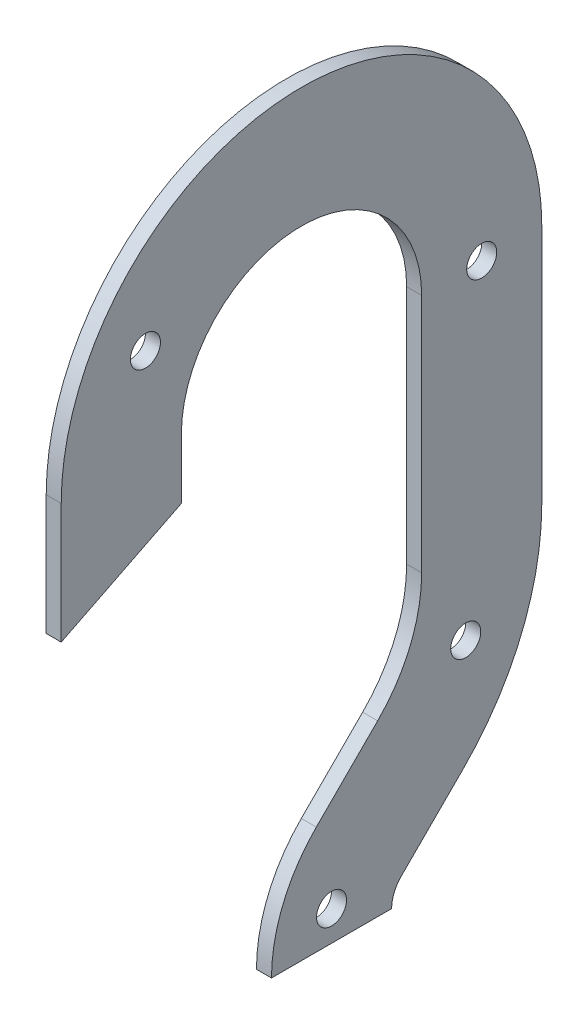
ISO-10303-21;
HEADER;
FILE_DESCRIPTION(('STEP AP214'),'2;1');
FILE_NAME('part.step','',(''),(''),'','','');
FILE_SCHEMA(('AUTOMOTIVE_DESIGN { 1 0 10303 214 1 1 1 1 }'));
ENDSEC;
DATA;
#1=APPLICATION_CONTEXT('core data for automotive mechanical design processes');
#2=APPLICATION_PROTOCOL_DEFINITION('international standard','automotive_design',2000,#1);
#3=PRODUCT_CONTEXT('',#1,'mechanical');
#4=PRODUCT('Part','Part','',(#3));
#5=PRODUCT_RELATED_PRODUCT_CATEGORY('part','',(#4));
#6=PRODUCT_DEFINITION_FORMATION('','',#4);
#7=PRODUCT_DEFINITION_CONTEXT('part definition',#1,'design');
#8=PRODUCT_DEFINITION('design','',#6,#7);
#9=PRODUCT_DEFINITION_SHAPE('','',#8);
#10=(LENGTH_UNIT() NAMED_UNIT(*) SI_UNIT(.MILLI.,.METRE.));
#11=(NAMED_UNIT(*) PLANE_ANGLE_UNIT() SI_UNIT($,.RADIAN.));
#12=(NAMED_UNIT(*) SI_UNIT($,.STERADIAN.) SOLID_ANGLE_UNIT());
#13=UNCERTAINTY_MEASURE_WITH_UNIT(LENGTH_MEASURE(1.E-05),#10,'distance_accuracy_value','');
#14=(GEOMETRIC_REPRESENTATION_CONTEXT(3) GLOBAL_UNCERTAINTY_ASSIGNED_CONTEXT((#13)) GLOBAL_UNIT_ASSIGNED_CONTEXT((#10,
#11,#12)) REPRESENTATION_CONTEXT('',''));
#15=CARTESIAN_POINT('',(0.,0.,0.));
#16=DIRECTION('',(0.,0.,1.));
#17=DIRECTION('',(1.,0.,0.));
#18=AXIS2_PLACEMENT_3D('',#15,#16,#17);
#19=CARTESIAN_POINT('',(3.175,0.,0.));
#20=DIRECTION('',(-1.,0.,0.));
#21=DIRECTION('',(0.,0.,1.));
#22=AXIS2_PLACEMENT_3D('',#19,#20,#21);
#23=CYLINDRICAL_SURFACE('',#22,50.8);
#24=CARTESIAN_POINT('',(0.,0.,0.));
#25=DIRECTION('',(1.,0.,0.));
#26=DIRECTION('',(0.,0.,-1.));
#27=AXIS2_PLACEMENT_3D('',#24,#25,#26);
#28=CIRCLE('',#27,50.8);
#29=CARTESIAN_POINT('',(0.,0.,-50.8));
#30=VERTEX_POINT('',#29);
#31=CARTESIAN_POINT('',(0.,0.,50.8));
#32=VERTEX_POINT('',#31);
#33=EDGE_CURVE('E168',#30,#32,#28,.T.);
#34=ORIENTED_EDGE('',*,*,#33,.T.);
#35=DIRECTION('',(-1.,0.,0.));
#36=VECTOR('',#35,1.);
#37=CARTESIAN_POINT('',(3.175,0.,50.8));
#38=LINE('',#37,#36);
#39=CARTESIAN_POINT('',(3.175,0.,50.8));
#40=VERTEX_POINT('',#39);
#41=EDGE_CURVE('E11',#40,#32,#38,.T.);
#42=ORIENTED_EDGE('',*,*,#41,.F.);
#43=CARTESIAN_POINT('',(3.175,0.,0.));
#44=DIRECTION('',(1.,0.,0.));
#45=DIRECTION('',(0.,0.,-1.));
#46=AXIS2_PLACEMENT_3D('',#43,#44,#45);
#47=CIRCLE('',#46,50.8);
#48=CARTESIAN_POINT('',(3.175,0.,-50.8));
#49=VERTEX_POINT('',#48);
#50=EDGE_CURVE('E195',#49,#40,#47,.T.);
#51=ORIENTED_EDGE('',*,*,#50,.F.);
#52=DIRECTION('',(-1.,0.,0.));
#53=VECTOR('',#52,1.);
#54=CARTESIAN_POINT('',(3.175,0.,-50.8));
#55=LINE('',#54,#53);
#56=EDGE_CURVE('E164',#49,#30,#55,.T.);
#57=ORIENTED_EDGE('',*,*,#56,.T.);
#58=EDGE_LOOP('',(#34,#42,#51,#57));
#59=FACE_BOUND('',#58,.T.);
#60=ADVANCED_FACE('F36',(#59),#23,.T.);
#61=CARTESIAN_POINT('',(3.175,0.,50.8));
#62=DIRECTION('',(0.,0.,-1.));
#63=DIRECTION('',(-1.,0.,0.));
#64=AXIS2_PLACEMENT_3D('',#61,#62,#63);
#65=PLANE('',#64);
#66=DIRECTION('',(0.,-1.,0.));
#67=VECTOR('',#66,1.);
#68=CARTESIAN_POINT('',(0.,0.,50.8));
#69=LINE('',#68,#67);
#70=CARTESIAN_POINT('',(0.,-25.4,50.8));
#71=VERTEX_POINT('',#70);
#72=EDGE_CURVE('E171',#32,#71,#69,.T.);
#73=ORIENTED_EDGE('',*,*,#72,.T.);
#74=DIRECTION('',(-1.,0.,0.));
#75=VECTOR('',#74,1.);
#76=CARTESIAN_POINT('',(3.175,-25.4,50.8));
#77=LINE('',#76,#75);
#78=CARTESIAN_POINT('',(3.175,-25.4,50.8));
#79=VERTEX_POINT('',#78);
#80=EDGE_CURVE('E44',#79,#71,#77,.T.);
#81=ORIENTED_EDGE('',*,*,#80,.F.);
#82=DIRECTION('',(0.,-1.,0.));
#83=VECTOR('',#82,1.);
#84=CARTESIAN_POINT('',(3.175,0.,50.8));
#85=LINE('',#84,#83);
#86=EDGE_CURVE('E113',#40,#79,#85,.T.);
#87=ORIENTED_EDGE('',*,*,#86,.F.);
#88=ORIENTED_EDGE('',*,*,#41,.T.);
#89=EDGE_LOOP('',(#73,#81,#87,#88));
#90=FACE_BOUND('',#89,.T.);
#91=ADVANCED_FACE('F284',(#90),#65,.F.);
#92=CARTESIAN_POINT('',(3.175,-25.4,50.8));
#93=DIRECTION('',(0.,0.894427190999916,0.447213595499958));
#94=DIRECTION('',(0.,-0.447213595499958,0.894427190999916));
#95=AXIS2_PLACEMENT_3D('',#92,#93,#94);
#96=PLANE('',#95);
#97=DIRECTION('',(0.,0.447213595499958,-0.894427190999916));
#98=VECTOR('',#97,1.);
#99=CARTESIAN_POINT('',(0.,-25.4,50.8));
#100=LINE('',#99,#98);
#101=CARTESIAN_POINT('',(0.,-12.7,25.4));
#102=VERTEX_POINT('',#101);
#103=EDGE_CURVE('E174',#71,#102,#100,.T.);
#104=ORIENTED_EDGE('',*,*,#103,.T.);
#105=DIRECTION('',(-1.,0.,0.));
#106=VECTOR('',#105,1.);
#107=CARTESIAN_POINT('',(3.175,-12.7,25.4));
#108=LINE('',#107,#106);
#109=CARTESIAN_POINT('',(3.175,-12.7,25.4));
#110=VERTEX_POINT('',#109);
#111=EDGE_CURVE('E220',#110,#102,#108,.T.);
#112=ORIENTED_EDGE('',*,*,#111,.F.);
#113=DIRECTION('',(0.,0.447213595499958,-0.894427190999916));
#114=VECTOR('',#113,1.);
#115=CARTESIAN_POINT('',(3.175,-25.4,50.8));
#116=LINE('',#115,#114);
#117=EDGE_CURVE('E228',#79,#110,#116,.T.);
#118=ORIENTED_EDGE('',*,*,#117,.F.);
#119=ORIENTED_EDGE('',*,*,#80,.T.);
#120=EDGE_LOOP('',(#104,#112,#118,#119));
#121=FACE_BOUND('',#120,.T.);
#122=ADVANCED_FACE('F226',(#121),#96,.F.);
#123=CARTESIAN_POINT('',(3.175,0.,25.4));
#124=DIRECTION('',(0.,0.,1.));
#125=DIRECTION('',(1.,0.,0.));
#126=AXIS2_PLACEMENT_3D('',#123,#124,#125);
#127=PLANE('',#126);
#128=DIRECTION('',(0.,1.,0.));
#129=VECTOR('',#128,1.);
#130=CARTESIAN_POINT('',(0.,0.,25.4));
#131=LINE('',#130,#129);
#132=CARTESIAN_POINT('',(0.,0.,25.4));
#133=VERTEX_POINT('',#132);
#134=EDGE_CURVE('E176',#102,#133,#131,.T.);
#135=ORIENTED_EDGE('',*,*,#134,.T.);
#136=DIRECTION('',(-1.,0.,0.));
#137=VECTOR('',#136,1.);
#138=CARTESIAN_POINT('',(3.175,0.,25.4));
#139=LINE('',#138,#137);
#140=CARTESIAN_POINT('',(3.175,0.,25.4));
#141=VERTEX_POINT('',#140);
#142=EDGE_CURVE('E217',#141,#133,#139,.T.);
#143=ORIENTED_EDGE('',*,*,#142,.F.);
#144=DIRECTION('',(0.,1.,0.));
#145=VECTOR('',#144,1.);
#146=CARTESIAN_POINT('',(3.175,0.,25.4));
#147=LINE('',#146,#145);
#148=EDGE_CURVE('E246',#110,#141,#147,.T.);
#149=ORIENTED_EDGE('',*,*,#148,.F.);
#150=ORIENTED_EDGE('',*,*,#111,.T.);
#151=EDGE_LOOP('',(#135,#143,#149,#150));
#152=FACE_BOUND('',#151,.T.);
#153=ADVANCED_FACE('F237',(#152),#127,.F.);
#154=CARTESIAN_POINT('',(3.175,0.,0.));
#155=DIRECTION('',(-1.,0.,0.));
#156=DIRECTION('',(0.,0.,1.));
#157=AXIS2_PLACEMENT_3D('',#154,#155,#156);
#158=CYLINDRICAL_SURFACE('',#157,25.4);
#159=CARTESIAN_POINT('',(0.,0.,0.));
#160=DIRECTION('',(-1.,0.,0.));
#161=DIRECTION('',(0.,0.,-1.));
#162=AXIS2_PLACEMENT_3D('',#159,#160,#161);
#163=CIRCLE('',#162,25.4);
#164=CARTESIAN_POINT('',(0.,0.,-25.4));
#165=VERTEX_POINT('',#164);
#166=EDGE_CURVE('E178',#133,#165,#163,.T.);
#167=ORIENTED_EDGE('',*,*,#166,.T.);
#168=DIRECTION('',(-1.,0.,0.));
#169=VECTOR('',#168,1.);
#170=CARTESIAN_POINT('',(3.175,0.,-25.4));
#171=LINE('',#170,#169);
#172=CARTESIAN_POINT('',(3.175,0.,-25.4));
#173=VERTEX_POINT('',#172);
#174=EDGE_CURVE('E214',#173,#165,#171,.T.);
#175=ORIENTED_EDGE('',*,*,#174,.F.);
#176=CARTESIAN_POINT('',(3.175,0.,0.));
#177=DIRECTION('',(-1.,0.,0.));
#178=DIRECTION('',(0.,0.,-1.));
#179=AXIS2_PLACEMENT_3D('',#176,#177,#178);
#180=CIRCLE('',#179,25.4);
#181=EDGE_CURVE('E243',#141,#173,#180,.T.);
#182=ORIENTED_EDGE('',*,*,#181,.F.);
#183=ORIENTED_EDGE('',*,*,#142,.T.);
#184=EDGE_LOOP('',(#167,#175,#182,#183));
#185=FACE_BOUND('',#184,.T.);
#186=ADVANCED_FACE('F241',(#185),#158,.F.);
#187=CARTESIAN_POINT('',(3.175,0.,-25.4));
#188=DIRECTION('',(0.,0.,-1.));
#189=DIRECTION('',(0.,1.,0.));
#190=AXIS2_PLACEMENT_3D('',#187,#188,#189);
#191=PLANE('',#190);
#192=DIRECTION('',(0.,-1.,0.));
#193=VECTOR('',#192,1.);
#194=CARTESIAN_POINT('',(0.,0.,-25.4));
#195=LINE('',#194,#193);
#196=CARTESIAN_POINT('',(0.,-50.8,-25.4));
#197=VERTEX_POINT('',#196);
#198=EDGE_CURVE('E180',#165,#197,#195,.T.);
#199=ORIENTED_EDGE('',*,*,#198,.T.);
#200=DIRECTION('',(-1.,0.,0.));
#201=VECTOR('',#200,1.);
#202=CARTESIAN_POINT('',(3.175,-50.8,-25.4));
#203=LINE('',#202,#201);
#204=CARTESIAN_POINT('',(3.175,-50.8,-25.4));
#205=VERTEX_POINT('',#204);
#206=EDGE_CURVE('E211',#205,#197,#203,.T.);
#207=ORIENTED_EDGE('',*,*,#206,.F.);
#208=DIRECTION('',(0.,-1.,0.));
#209=VECTOR('',#208,1.);
#210=CARTESIAN_POINT('',(3.175,0.,-25.4));
#211=LINE('',#210,#209);
#212=EDGE_CURVE('E245',#173,#205,#211,.T.);
#213=ORIENTED_EDGE('',*,*,#212,.F.);
#214=ORIENTED_EDGE('',*,*,#174,.T.);
#215=EDGE_LOOP('',(#199,#207,#213,#214));
#216=FACE_BOUND('',#215,.T.);
#217=ADVANCED_FACE('F297',(#216),#191,.F.);
#218=CARTESIAN_POINT('',(3.175,-50.8,6.34999999999999));
#219=DIRECTION('',(-1.,0.,0.));
#220=DIRECTION('',(0.,0.,1.));
#221=AXIS2_PLACEMENT_3D('',#218,#219,#220);
#222=CYLINDRICAL_SURFACE('',#221,31.75);
#223=CARTESIAN_POINT('',(0.,-50.8,6.34999999999999));
#224=DIRECTION('',(-1.,0.,0.));
#225=DIRECTION('',(0.,0.,1.));
#226=AXIS2_PLACEMENT_3D('',#223,#224,#225);
#227=CIRCLE('',#226,31.75);
#228=CARTESIAN_POINT('',(0.,-73.2506403026729,-16.1006403026729));
#229=VERTEX_POINT('',#228);
#230=EDGE_CURVE('E182',#197,#229,#227,.T.);
#231=ORIENTED_EDGE('',*,*,#230,.T.);
#232=DIRECTION('',(-1.,0.,0.));
#233=VECTOR('',#232,1.);
#234=CARTESIAN_POINT('',(3.175,-73.2506403026729,-16.1006403026729));
#235=LINE('',#234,#233);
#236=CARTESIAN_POINT('',(3.175,-73.2506403026729,-16.1006403026729));
#237=VERTEX_POINT('',#236);
#238=EDGE_CURVE('E208',#237,#229,#235,.T.);
#239=ORIENTED_EDGE('',*,*,#238,.F.);
#240=CARTESIAN_POINT('',(3.175,-50.8,6.34999999999999));
#241=DIRECTION('',(-1.,0.,0.));
#242=DIRECTION('',(0.,0.,1.));
#243=AXIS2_PLACEMENT_3D('',#240,#241,#242);
#244=CIRCLE('',#243,31.75);
#245=EDGE_CURVE('E248',#205,#237,#244,.T.);
#246=ORIENTED_EDGE('',*,*,#245,.F.);
#247=ORIENTED_EDGE('',*,*,#206,.T.);
#248=EDGE_LOOP('',(#231,#239,#246,#247));
#249=FACE_BOUND('',#248,.T.);
#250=ADVANCED_FACE('F300',(#249),#222,.F.);
#251=CARTESIAN_POINT('',(3.175,-73.2506403026729,-16.1006403026729));
#252=DIRECTION('',(0.,-0.707106781186549,-0.707106781186545));
#253=DIRECTION('',(0.,0.707106781186545,-0.70710678118655));
#254=AXIS2_PLACEMENT_3D('',#251,#252,#253);
#255=PLANE('',#254);
#256=DIRECTION('',(0.,-0.707106781186545,0.70710678118655));
#257=VECTOR('',#256,1.);
#258=CARTESIAN_POINT('',(0.,-73.2506403026729,-16.1006403026729));
#259=LINE('',#258,#257);
#260=CARTESIAN_POINT('',(0.,-86.2206456830181,-3.13063492232763));
#261=VERTEX_POINT('',#260);
#262=EDGE_CURVE('E184',#229,#261,#259,.T.);
#263=ORIENTED_EDGE('',*,*,#262,.T.);
#264=DIRECTION('',(-1.,0.,0.));
#265=VECTOR('',#264,1.);
#266=CARTESIAN_POINT('',(3.175,-86.2206456830181,-3.13063492232763));
#267=LINE('',#266,#265);
#268=CARTESIAN_POINT('',(3.175,-86.2206456830181,-3.13063492232763));
#269=VERTEX_POINT('',#268);
#270=EDGE_CURVE('E205',#269,#261,#267,.T.);
#271=ORIENTED_EDGE('',*,*,#270,.F.);
#272=DIRECTION('',(0.,-0.707106781186545,0.70710678118655));
#273=VECTOR('',#272,1.);
#274=CARTESIAN_POINT('',(3.175,-73.2506403026729,-16.1006403026729));
#275=LINE('',#274,#273);
#276=EDGE_CURVE('E254',#237,#269,#275,.T.);
#277=ORIENTED_EDGE('',*,*,#276,.F.);
#278=ORIENTED_EDGE('',*,*,#238,.T.);
#279=EDGE_LOOP('',(#263,#271,#277,#278));
#280=FACE_BOUND('',#279,.T.);
#281=ADVANCED_FACE('F304',(#280),#255,.F.);
#282=CARTESIAN_POINT('',(3.175,-109.108923092409,-26.0189123317189));
#283=DIRECTION('',(-1.,0.,0.));
#284=DIRECTION('',(0.,0.,1.));
#285=AXIS2_PLACEMENT_3D('',#282,#283,#284);
#286=CYLINDRICAL_SURFACE('',#285,32.3689123317189);
#287=CARTESIAN_POINT('',(0.,-109.108923092409,-26.0189123317189));
#288=DIRECTION('',(1.,0.,0.));
#289=DIRECTION('',(0.,0.,-1.));
#290=AXIS2_PLACEMENT_3D('',#287,#288,#289);
#291=CIRCLE('',#290,32.3689123317189);
#292=CARTESIAN_POINT('',(0.,-109.108923092409,6.34999999999998));
#293=VERTEX_POINT('',#292);
#294=EDGE_CURVE('E186',#261,#293,#291,.T.);
#295=ORIENTED_EDGE('',*,*,#294,.T.);
#296=DIRECTION('',(-1.,0.,0.));
#297=VECTOR('',#296,1.);
#298=CARTESIAN_POINT('',(3.175,-109.108923092409,6.34999999999998));
#299=LINE('',#298,#297);
#300=CARTESIAN_POINT('',(3.175,-109.108923092409,6.34999999999998));
#301=VERTEX_POINT('',#300);
#302=EDGE_CURVE('E202',#301,#293,#299,.T.);
#303=ORIENTED_EDGE('',*,*,#302,.F.);
#304=CARTESIAN_POINT('',(3.175,-109.108923092409,-26.0189123317189));
#305=DIRECTION('',(1.,0.,0.));
#306=DIRECTION('',(0.,0.,-1.));
#307=AXIS2_PLACEMENT_3D('',#304,#305,#306);
#308=CIRCLE('',#307,32.3689123317189);
#309=EDGE_CURVE('E256',#269,#301,#308,.T.);
#310=ORIENTED_EDGE('',*,*,#309,.F.);
#311=ORIENTED_EDGE('',*,*,#270,.T.);
#312=EDGE_LOOP('',(#295,#303,#310,#311));
#313=FACE_BOUND('',#312,.T.);
#314=ADVANCED_FACE('F308',(#313),#286,.T.);
#315=CARTESIAN_POINT('',(3.175,-109.108923092409,6.34999999999998));
#316=DIRECTION('',(0.,1.,0.));
#317=DIRECTION('',(0.,0.,1.));
#318=AXIS2_PLACEMENT_3D('',#315,#316,#317);
#319=PLANE('',#318);
#320=DIRECTION('',(0.,0.,-1.));
#321=VECTOR('',#320,1.);
#322=CARTESIAN_POINT('',(0.,-109.108923092409,6.34999999999998));
#323=LINE('',#322,#321);
#324=CARTESIAN_POINT('',(0.,-109.108923092409,-19.05));
#325=VERTEX_POINT('',#324);
#326=EDGE_CURVE('E188',#293,#325,#323,.T.);
#327=ORIENTED_EDGE('',*,*,#326,.T.);
#328=DIRECTION('',(-1.,0.,0.));
#329=VECTOR('',#328,1.);
#330=CARTESIAN_POINT('',(3.175,-109.108923092409,-19.05));
#331=LINE('',#330,#329);
#332=CARTESIAN_POINT('',(3.175,-109.108923092409,-19.05));
#333=VERTEX_POINT('',#332);
#334=EDGE_CURVE('E199',#333,#325,#331,.T.);
#335=ORIENTED_EDGE('',*,*,#334,.F.);
#336=DIRECTION('',(0.,0.,-1.));
#337=VECTOR('',#336,1.);
#338=CARTESIAN_POINT('',(3.175,-109.108923092409,6.34999999999998));
#339=LINE('',#338,#337);
#340=EDGE_CURVE('E258',#301,#333,#339,.T.);
#341=ORIENTED_EDGE('',*,*,#340,.F.);
#342=ORIENTED_EDGE('',*,*,#302,.T.);
#343=EDGE_LOOP('',(#327,#335,#341,#342));
#344=FACE_BOUND('',#343,.T.);
#345=ADVANCED_FACE('F264',(#344),#319,.F.);
#346=CARTESIAN_POINT('',(3.175,-109.108923092409,-26.0189123317189));
#347=DIRECTION('',(-1.,0.,0.));
#348=DIRECTION('',(0.,0.,1.));
#349=AXIS2_PLACEMENT_3D('',#346,#347,#348);
#350=CYLINDRICAL_SURFACE('',#349,6.96891233171893);
#351=CARTESIAN_POINT('',(0.,-109.108923092409,-26.0189123317189));
#352=DIRECTION('',(-1.,0.,0.));
#353=DIRECTION('',(0.,0.,-1.));
#354=AXIS2_PLACEMENT_3D('',#351,#352,#353);
#355=CIRCLE('',#354,6.96891233171893);
#356=CARTESIAN_POINT('',(0.,-104.181157925156,-21.0911471644659));
#357=VERTEX_POINT('',#356);
#358=EDGE_CURVE('E190',#325,#357,#355,.T.);
#359=ORIENTED_EDGE('',*,*,#358,.T.);
#360=DIRECTION('',(-1.,0.,0.));
#361=VECTOR('',#360,1.);
#362=CARTESIAN_POINT('',(3.175,-104.181157925156,-21.0911471644659));
#363=LINE('',#362,#361);
#364=CARTESIAN_POINT('',(3.175,-104.181157925156,-21.0911471644659));
#365=VERTEX_POINT('',#364);
#366=EDGE_CURVE('E159',#365,#357,#363,.T.);
#367=ORIENTED_EDGE('',*,*,#366,.F.);
#368=CARTESIAN_POINT('',(3.175,-109.108923092409,-26.0189123317189));
#369=DIRECTION('',(-1.,0.,0.));
#370=DIRECTION('',(0.,0.,-1.));
#371=AXIS2_PLACEMENT_3D('',#368,#369,#370);
#372=CIRCLE('',#371,6.96891233171893);
#373=EDGE_CURVE('E150',#333,#365,#372,.T.);
#374=ORIENTED_EDGE('',*,*,#373,.F.);
#375=ORIENTED_EDGE('',*,*,#334,.T.);
#376=EDGE_LOOP('',(#359,#367,#374,#375));
#377=FACE_BOUND('',#376,.T.);
#378=ADVANCED_FACE('F268',(#377),#350,.F.);
#379=CARTESIAN_POINT('',(3.175,-91.2111525448112,-34.0611525448111));
#380=DIRECTION('',(0.,0.707106781186548,0.707106781186547));
#381=DIRECTION('',(0.,-0.707106781186547,0.707106781186548));
#382=AXIS2_PLACEMENT_3D('',#379,#380,#381);
#383=PLANE('',#382);
#384=DIRECTION('',(0.,0.707106781186547,-0.707106781186549));
#385=VECTOR('',#384,1.);
#386=CARTESIAN_POINT('',(0.,-91.2111525448112,-34.0611525448111));
#387=LINE('',#386,#385);
#388=CARTESIAN_POINT('',(0.,-91.2111525448112,-34.0611525448111));
#389=VERTEX_POINT('',#388);
#390=EDGE_CURVE('E158',#357,#389,#387,.T.);
#391=ORIENTED_EDGE('',*,*,#390,.T.);
#392=DIRECTION('',(-1.,0.,0.));
#393=VECTOR('',#392,1.);
#394=CARTESIAN_POINT('',(3.175,-91.2111525448112,-34.0611525448111));
#395=LINE('',#394,#393);
#396=CARTESIAN_POINT('',(3.175,-91.2111525448112,-34.0611525448111));
#397=VERTEX_POINT('',#396);
#398=EDGE_CURVE('E155',#397,#389,#395,.T.);
#399=ORIENTED_EDGE('',*,*,#398,.F.);
#400=DIRECTION('',(0.,0.707106781186547,-0.707106781186549));
#401=VECTOR('',#400,1.);
#402=CARTESIAN_POINT('',(3.175,-91.2111525448112,-34.0611525448111));
#403=LINE('',#402,#401);
#404=EDGE_CURVE('E144',#365,#397,#403,.T.);
#405=ORIENTED_EDGE('',*,*,#404,.F.);
#406=ORIENTED_EDGE('',*,*,#366,.T.);
#407=EDGE_LOOP('',(#391,#399,#405,#406));
#408=FACE_BOUND('',#407,.T.);
#409=ADVANCED_FACE('F156',(#408),#383,.F.);
#410=CARTESIAN_POINT('',(3.175,-50.8,6.34999999999999));
#411=DIRECTION('',(-1.,0.,0.));
#412=DIRECTION('',(0.,0.,1.));
#413=AXIS2_PLACEMENT_3D('',#410,#411,#412);
#414=CYLINDRICAL_SURFACE('',#413,57.15);
#415=CARTESIAN_POINT('',(0.,-50.8,6.34999999999999));
#416=DIRECTION('',(1.,0.,0.));
#417=DIRECTION('',(0.,0.,1.));
#418=AXIS2_PLACEMENT_3D('',#415,#416,#417);
#419=CIRCLE('',#418,57.15);
#420=CARTESIAN_POINT('',(0.,-50.8,-50.8));
#421=VERTEX_POINT('',#420);
#422=EDGE_CURVE('E99',#389,#421,#419,.T.);
#423=ORIENTED_EDGE('',*,*,#422,.T.);
#424=DIRECTION('',(-1.,0.,0.));
#425=VECTOR('',#424,1.);
#426=CARTESIAN_POINT('',(3.175,-50.8,-50.8));
#427=LINE('',#426,#425);
#428=CARTESIAN_POINT('',(3.175,-50.8,-50.8));
#429=VERTEX_POINT('',#428);
#430=EDGE_CURVE('E160',#429,#421,#427,.T.);
#431=ORIENTED_EDGE('',*,*,#430,.F.);
#432=CARTESIAN_POINT('',(3.175,-50.8,6.34999999999999));
#433=DIRECTION('',(1.,0.,0.));
#434=DIRECTION('',(0.,0.,1.));
#435=AXIS2_PLACEMENT_3D('',#432,#433,#434);
#436=CIRCLE('',#435,57.15);
#437=EDGE_CURVE('E148',#397,#429,#436,.T.);
#438=ORIENTED_EDGE('',*,*,#437,.F.);
#439=ORIENTED_EDGE('',*,*,#398,.T.);
#440=EDGE_LOOP('',(#423,#431,#438,#439));
#441=FACE_BOUND('',#440,.T.);
#442=ADVANCED_FACE('F162',(#441),#414,.T.);
#443=CARTESIAN_POINT('',(3.175,-50.8,-50.8));
#444=DIRECTION('',(0.,0.,1.));
#445=DIRECTION('',(1.,0.,0.));
#446=AXIS2_PLACEMENT_3D('',#443,#444,#445);
#447=PLANE('',#446);
#448=DIRECTION('',(0.,1.,0.));
#449=VECTOR('',#448,1.);
#450=CARTESIAN_POINT('',(0.,-50.8,-50.8));
#451=LINE('',#450,#449);
#452=EDGE_CURVE('E105',#421,#30,#451,.T.);
#453=ORIENTED_EDGE('',*,*,#452,.T.);
#454=ORIENTED_EDGE('',*,*,#56,.F.);
#455=DIRECTION('',(0.,1.,0.));
#456=VECTOR('',#455,1.);
#457=CARTESIAN_POINT('',(3.175,-50.8,-50.8));
#458=LINE('',#457,#456);
#459=EDGE_CURVE('E52',#429,#49,#458,.T.);
#460=ORIENTED_EDGE('',*,*,#459,.F.);
#461=ORIENTED_EDGE('',*,*,#430,.T.);
#462=EDGE_LOOP('',(#453,#454,#460,#461));
#463=FACE_BOUND('',#462,.T.);
#464=ADVANCED_FACE('F272',(#463),#447,.F.);
#465=CARTESIAN_POINT('',(3.175,0.,0.));
#466=DIRECTION('',(1.,0.,0.));
#467=DIRECTION('',(0.,0.,-1.));
#468=AXIS2_PLACEMENT_3D('',#465,#466,#467);
#469=PLANE('',#468);
#470=CARTESIAN_POINT('',(3.175,-102.75892309241,-6.35));
#471=DIRECTION('',(1.,0.,0.));
#472=DIRECTION('',(0.,0.,-1.));
#473=AXIS2_PLACEMENT_3D('',#470,#471,#472);
#474=CIRCLE('',#473,3.175);
#475=CARTESIAN_POINT('',(3.175,-102.75892309241,-9.525));
#476=VERTEX_POINT('',#475);
#477=EDGE_CURVE('E394',#476,#476,#474,.T.);
#478=ORIENTED_EDGE('',*,*,#477,.F.);
#479=EDGE_LOOP('',(#478));
#480=FACE_BOUND('',#479,.T.);
#481=CARTESIAN_POINT('',(3.175,-67.8102785686283,-34.7164452201267));
#482=DIRECTION('',(1.,0.,0.));
#483=DIRECTION('',(0.,0.,-1.));
#484=AXIS2_PLACEMENT_3D('',#481,#482,#483);
#485=CIRCLE('',#484,3.175);
#486=CARTESIAN_POINT('',(3.175,-67.8102785686283,-37.8914452201267));
#487=VERTEX_POINT('',#486);
#488=EDGE_CURVE('E396',#487,#487,#485,.T.);
#489=ORIENTED_EDGE('',*,*,#488,.F.);
#490=EDGE_LOOP('',(#489));
#491=FACE_BOUND('',#490,.T.);
#492=CARTESIAN_POINT('',(3.175,19.0499999999998,32.9955678841872));
#493=DIRECTION('',(1.,0.,0.));
#494=DIRECTION('',(0.,0.,-1.));
#495=AXIS2_PLACEMENT_3D('',#492,#493,#494);
#496=CIRCLE('',#495,3.175);
#497=CARTESIAN_POINT('',(3.175,19.0499999999998,29.8205678841872));
#498=VERTEX_POINT('',#497);
#499=EDGE_CURVE('E410',#498,#498,#496,.T.);
#500=ORIENTED_EDGE('',*,*,#499,.F.);
#501=EDGE_LOOP('',(#500));
#502=FACE_BOUND('',#501,.T.);
#503=CARTESIAN_POINT('',(3.175,0.,-38.1));
#504=DIRECTION('',(1.,0.,0.));
#505=DIRECTION('',(0.,0.,-1.));
#506=AXIS2_PLACEMENT_3D('',#503,#504,#505);
#507=CIRCLE('',#506,3.175);
#508=CARTESIAN_POINT('',(3.175,0.,-41.275));
#509=VERTEX_POINT('',#508);
#510=EDGE_CURVE('E402',#509,#509,#507,.T.);
#511=ORIENTED_EDGE('',*,*,#510,.F.);
#512=EDGE_LOOP('',(#511));
#513=FACE_BOUND('',#512,.T.);
#514=ORIENTED_EDGE('',*,*,#50,.T.);
#515=ORIENTED_EDGE('',*,*,#86,.T.);
#516=ORIENTED_EDGE('',*,*,#117,.T.);
#517=ORIENTED_EDGE('',*,*,#148,.T.);
#518=ORIENTED_EDGE('',*,*,#181,.T.);
#519=ORIENTED_EDGE('',*,*,#212,.T.);
#520=ORIENTED_EDGE('',*,*,#245,.T.);
#521=ORIENTED_EDGE('',*,*,#276,.T.);
#522=ORIENTED_EDGE('',*,*,#309,.T.);
#523=ORIENTED_EDGE('',*,*,#340,.T.);
#524=ORIENTED_EDGE('',*,*,#373,.T.);
#525=ORIENTED_EDGE('',*,*,#404,.T.);
#526=ORIENTED_EDGE('',*,*,#437,.T.);
#527=ORIENTED_EDGE('',*,*,#459,.T.);
#528=EDGE_LOOP('',(#514,#515,#516,#517,#518,#519,#520,#521,#522,#523,#524,#525,#526,#527));
#529=FACE_BOUND('',#528,.T.);
#530=ADVANCED_FACE('F146',(#480,#491,#502,#513,#529),#469,.T.);
#531=CARTESIAN_POINT('',(0.,0.,0.));
#532=DIRECTION('',(1.,0.,0.));
#533=DIRECTION('',(0.,0.,-1.));
#534=AXIS2_PLACEMENT_3D('',#531,#532,#533);
#535=PLANE('',#534);
#536=CARTESIAN_POINT('',(0.,-102.75892309241,-6.35));
#537=DIRECTION('',(1.,0.,0.));
#538=DIRECTION('',(0.,0.,-1.));
#539=AXIS2_PLACEMENT_3D('',#536,#537,#538);
#540=CIRCLE('',#539,3.175);
#541=CARTESIAN_POINT('',(0.,-102.75892309241,-9.525));
#542=VERTEX_POINT('',#541);
#543=EDGE_CURVE('E391',#542,#542,#540,.T.);
#544=ORIENTED_EDGE('',*,*,#543,.T.);
#545=EDGE_LOOP('',(#544));
#546=FACE_BOUND('',#545,.T.);
#547=CARTESIAN_POINT('',(0.,-67.8102785686283,-34.7164452201267));
#548=DIRECTION('',(1.,0.,0.));
#549=DIRECTION('',(0.,0.,-1.));
#550=AXIS2_PLACEMENT_3D('',#547,#548,#549);
#551=CIRCLE('',#550,3.175);
#552=CARTESIAN_POINT('',(0.,-67.8102785686283,-37.8914452201267));
#553=VERTEX_POINT('',#552);
#554=EDGE_CURVE('E415',#553,#553,#551,.T.);
#555=ORIENTED_EDGE('',*,*,#554,.T.);
#556=EDGE_LOOP('',(#555));
#557=FACE_BOUND('',#556,.T.);
#558=CARTESIAN_POINT('',(0.,19.0499999999998,32.9955678841872));
#559=DIRECTION('',(1.,0.,0.));
#560=DIRECTION('',(0.,0.,-1.));
#561=AXIS2_PLACEMENT_3D('',#558,#559,#560);
#562=CIRCLE('',#561,3.175);
#563=CARTESIAN_POINT('',(0.,19.0499999999998,29.8205678841872));
#564=VERTEX_POINT('',#563);
#565=EDGE_CURVE('E405',#564,#564,#562,.T.);
#566=ORIENTED_EDGE('',*,*,#565,.T.);
#567=EDGE_LOOP('',(#566));
#568=FACE_BOUND('',#567,.T.);
#569=CARTESIAN_POINT('',(0.,0.,-38.1));
#570=DIRECTION('',(1.,0.,0.));
#571=DIRECTION('',(0.,0.,-1.));
#572=AXIS2_PLACEMENT_3D('',#569,#570,#571);
#573=CIRCLE('',#572,3.175);
#574=CARTESIAN_POINT('',(0.,0.,-41.275));
#575=VERTEX_POINT('',#574);
#576=EDGE_CURVE('E172',#575,#575,#573,.T.);
#577=ORIENTED_EDGE('',*,*,#576,.T.);
#578=EDGE_LOOP('',(#577));
#579=FACE_BOUND('',#578,.T.);
#580=ORIENTED_EDGE('',*,*,#33,.F.);
#581=ORIENTED_EDGE('',*,*,#452,.F.);
#582=ORIENTED_EDGE('',*,*,#422,.F.);
#583=ORIENTED_EDGE('',*,*,#390,.F.);
#584=ORIENTED_EDGE('',*,*,#358,.F.);
#585=ORIENTED_EDGE('',*,*,#326,.F.);
#586=ORIENTED_EDGE('',*,*,#294,.F.);
#587=ORIENTED_EDGE('',*,*,#262,.F.);
#588=ORIENTED_EDGE('',*,*,#230,.F.);
#589=ORIENTED_EDGE('',*,*,#198,.F.);
#590=ORIENTED_EDGE('',*,*,#166,.F.);
#591=ORIENTED_EDGE('',*,*,#134,.F.);
#592=ORIENTED_EDGE('',*,*,#103,.F.);
#593=ORIENTED_EDGE('',*,*,#72,.F.);
#594=EDGE_LOOP('',(#580,#581,#582,#583,#584,#585,#586,#587,#588,#589,#590,#591,#592,#593));
#595=FACE_BOUND('',#594,.T.);
#596=ADVANCED_FACE('F232',(#546,#557,#568,#579,#595),#535,.F.);
#597=CARTESIAN_POINT('',(0.,0.,-38.1));
#598=DIRECTION('',(1.,0.,0.));
#599=DIRECTION('',(0.,0.,-1.));
#600=AXIS2_PLACEMENT_3D('',#597,#598,#599);
#601=CYLINDRICAL_SURFACE('',#600,3.175);
#602=ORIENTED_EDGE('',*,*,#576,.F.);
#603=EDGE_LOOP('',(#602));
#604=FACE_BOUND('',#603,.T.);
#605=ORIENTED_EDGE('',*,*,#510,.T.);
#606=EDGE_LOOP('',(#605));
#607=FACE_BOUND('',#606,.T.);
#608=ADVANCED_FACE('F345',(#604,#607),#601,.F.);
#609=CARTESIAN_POINT('',(0.,19.0499999999998,32.9955678841872));
#610=DIRECTION('',(1.,0.,0.));
#611=DIRECTION('',(0.,0.,-1.));
#612=AXIS2_PLACEMENT_3D('',#609,#610,#611);
#613=CYLINDRICAL_SURFACE('',#612,3.175);
#614=ORIENTED_EDGE('',*,*,#565,.F.);
#615=EDGE_LOOP('',(#614));
#616=FACE_BOUND('',#615,.T.);
#617=ORIENTED_EDGE('',*,*,#499,.T.);
#618=EDGE_LOOP('',(#617));
#619=FACE_BOUND('',#618,.T.);
#620=ADVANCED_FACE('F354',(#616,#619),#613,.F.);
#621=CARTESIAN_POINT('',(0.,-67.8102785686283,-34.7164452201267));
#622=DIRECTION('',(1.,0.,0.));
#623=DIRECTION('',(0.,0.,-1.));
#624=AXIS2_PLACEMENT_3D('',#621,#622,#623);
#625=CYLINDRICAL_SURFACE('',#624,3.175);
#626=ORIENTED_EDGE('',*,*,#554,.F.);
#627=EDGE_LOOP('',(#626));
#628=FACE_BOUND('',#627,.T.);
#629=ORIENTED_EDGE('',*,*,#488,.T.);
#630=EDGE_LOOP('',(#629));
#631=FACE_BOUND('',#630,.T.);
#632=ADVANCED_FACE('F364',(#628,#631),#625,.F.);
#633=CARTESIAN_POINT('',(0.,-102.75892309241,-6.35));
#634=DIRECTION('',(1.,0.,0.));
#635=DIRECTION('',(0.,0.,-1.));
#636=AXIS2_PLACEMENT_3D('',#633,#634,#635);
#637=CYLINDRICAL_SURFACE('',#636,3.175);
#638=ORIENTED_EDGE('',*,*,#543,.F.);
#639=EDGE_LOOP('',(#638));
#640=FACE_BOUND('',#639,.T.);
#641=ORIENTED_EDGE('',*,*,#477,.T.);
#642=EDGE_LOOP('',(#641));
#643=FACE_BOUND('',#642,.T.);
#644=ADVANCED_FACE('F374',(#640,#643),#637,.F.);
#645=CLOSED_SHELL('',(#60,#91,#122,#153,#186,#217,#250,#281,#314,#345,#378,#409,#442,#464,#530,
#596,#608,#620,#632,#644));
#646=MANIFOLD_SOLID_BREP('B2',#645);
#647=ADVANCED_BREP_SHAPE_REPRESENTATION('',(#18,#646),#14);
#648=SHAPE_DEFINITION_REPRESENTATION(#9,#647);
ENDSEC;
END-ISO-10303-21;
